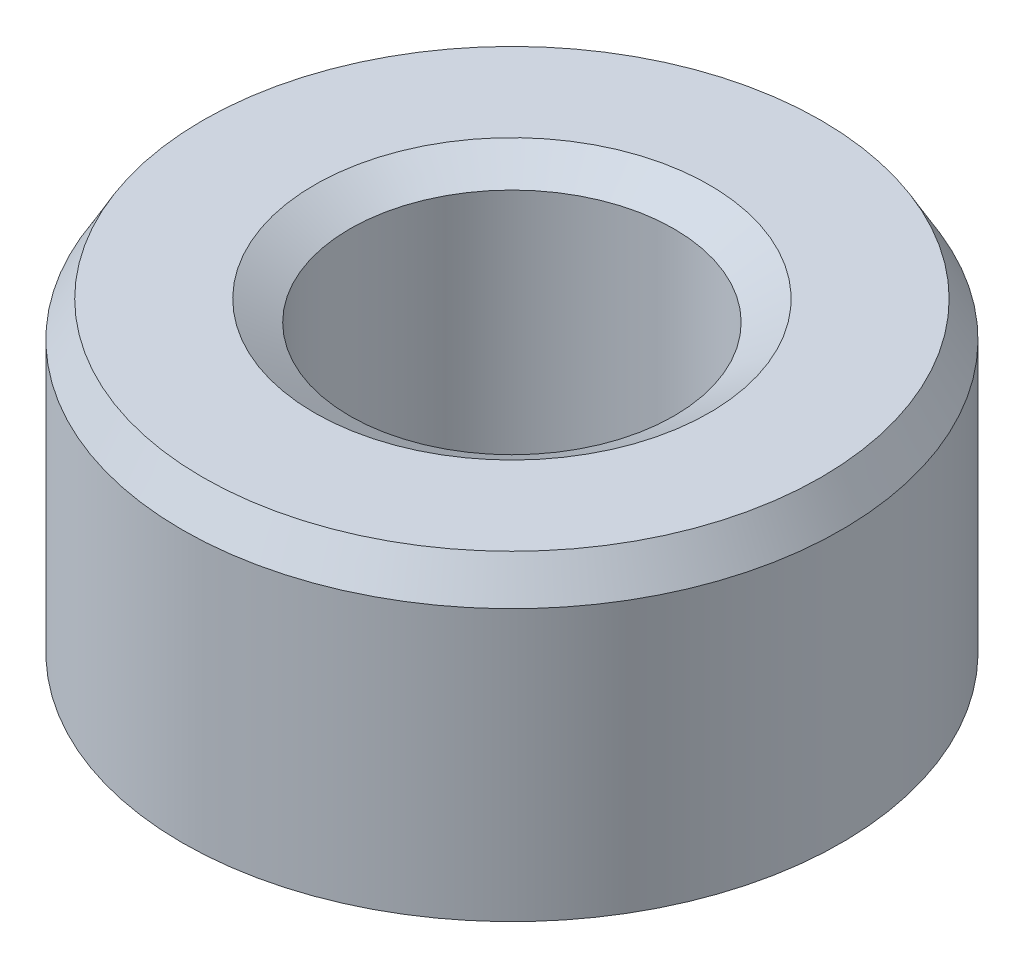
ISO-10303-21;
HEADER;
FILE_DESCRIPTION(('STEP AP214'),'2;1');
FILE_NAME('part.step','',(''),(''),'','','');
FILE_SCHEMA(('AUTOMOTIVE_DESIGN { 1 0 10303 214 1 1 1 1 }'));
ENDSEC;
DATA;
#1=APPLICATION_CONTEXT('core data for automotive mechanical design processes');
#2=APPLICATION_PROTOCOL_DEFINITION('international standard','automotive_design',2000,#1);
#3=PRODUCT_CONTEXT('',#1,'mechanical');
#4=PRODUCT('Part','Part','',(#3));
#5=PRODUCT_RELATED_PRODUCT_CATEGORY('part','',(#4));
#6=PRODUCT_DEFINITION_FORMATION('','',#4);
#7=PRODUCT_DEFINITION_CONTEXT('part definition',#1,'design');
#8=PRODUCT_DEFINITION('design','',#6,#7);
#9=PRODUCT_DEFINITION_SHAPE('','',#8);
#10=(LENGTH_UNIT() NAMED_UNIT(*) SI_UNIT(.MILLI.,.METRE.));
#11=(NAMED_UNIT(*) PLANE_ANGLE_UNIT() SI_UNIT($,.RADIAN.));
#12=(NAMED_UNIT(*) SI_UNIT($,.STERADIAN.) SOLID_ANGLE_UNIT());
#13=UNCERTAINTY_MEASURE_WITH_UNIT(LENGTH_MEASURE(1.E-05),#10,'distance_accuracy_value','');
#14=(GEOMETRIC_REPRESENTATION_CONTEXT(3) GLOBAL_UNCERTAINTY_ASSIGNED_CONTEXT((#13)) GLOBAL_UNIT_ASSIGNED_CONTEXT((#10,
#11,#12)) REPRESENTATION_CONTEXT('',''));
#15=CARTESIAN_POINT('',(0.,0.,0.));
#16=DIRECTION('',(0.,0.,1.));
#17=DIRECTION('',(1.,0.,0.));
#18=AXIS2_PLACEMENT_3D('',#15,#16,#17);
#19=CARTESIAN_POINT('',(0.,34.6985275008784,0.));
#20=DIRECTION('',(0.,-1.,0.));
#21=DIRECTION('',(0.,0.,-1.));
#22=AXIS2_PLACEMENT_3D('',#19,#20,#21);
#23=CYLINDRICAL_SURFACE('',#22,35.);
#24=CARTESIAN_POINT('',(0.,2.16580570600962,0.));
#25=DIRECTION('',(0.,1.,0.));
#26=DIRECTION('',(0.,0.,1.));
#27=AXIS2_PLACEMENT_3D('',#24,#25,#26);
#28=CIRCLE('',#27,35.);
#29=CARTESIAN_POINT('',(0.,2.16580570600962,35.));
#30=VERTEX_POINT('',#29);
#31=EDGE_CURVE('E10',#30,#30,#28,.T.);
#32=ORIENTED_EDGE('',*,*,#31,.T.);
#33=EDGE_LOOP('',(#32));
#34=FACE_BOUND('',#33,.T.);
#35=CARTESIAN_POINT('',(0.,30.947241978747,0.));
#36=DIRECTION('',(0.,1.,0.));
#37=DIRECTION('',(0.,0.,1.));
#38=AXIS2_PLACEMENT_3D('',#35,#36,#37);
#39=CIRCLE('',#38,35.);
#40=CARTESIAN_POINT('',(0.,30.947241978747,35.));
#41=VERTEX_POINT('',#40);
#42=EDGE_CURVE('E50',#41,#41,#39,.F.);
#43=ORIENTED_EDGE('',*,*,#42,.T.);
#44=EDGE_LOOP('',(#43));
#45=FACE_BOUND('',#44,.T.);
#46=ADVANCED_FACE('F39',(#34,#45),#23,.T.);
#47=CARTESIAN_POINT('',(0.,34.6985275008784,0.));
#48=DIRECTION('',(0.,1.,0.));
#49=DIRECTION('',(0.,0.,1.));
#50=AXIS2_PLACEMENT_3D('',#47,#48,#49);
#51=PLANE('',#50);
#52=CARTESIAN_POINT('',(0.,34.6985275008784,0.));
#53=DIRECTION('',(0.,1.,0.));
#54=DIRECTION('',(0.,0.,1.));
#55=AXIS2_PLACEMENT_3D('',#52,#53,#54);
#56=CIRCLE('',#55,20.9676494009495);
#57=CARTESIAN_POINT('',(0.,34.6985275008784,20.9676494009495));
#58=VERTEX_POINT('',#57);
#59=EDGE_CURVE('E58',#58,#58,#56,.F.);
#60=ORIENTED_EDGE('',*,*,#59,.T.);
#61=EDGE_LOOP('',(#60));
#62=FACE_BOUND('',#61,.T.);
#63=CARTESIAN_POINT('',(0.,34.6985275008784,0.));
#64=DIRECTION('',(0.,1.,0.));
#65=DIRECTION('',(0.,0.,1.));
#66=AXIS2_PLACEMENT_3D('',#63,#64,#65);
#67=CIRCLE('',#66,32.8341942939904);
#68=CARTESIAN_POINT('',(0.,34.6985275008784,32.8341942939904));
#69=VERTEX_POINT('',#68);
#70=EDGE_CURVE('E61',#69,#69,#67,.T.);
#71=ORIENTED_EDGE('',*,*,#70,.T.);
#72=EDGE_LOOP('',(#71));
#73=FACE_BOUND('',#72,.T.);
#74=ADVANCED_FACE('F88',(#62,#73),#51,.T.);
#75=CARTESIAN_POINT('',(0.,0.,0.));
#76=DIRECTION('',(0.,1.,0.));
#77=DIRECTION('',(0.,0.,1.));
#78=AXIS2_PLACEMENT_3D('',#75,#76,#77);
#79=PLANE('',#78);
#80=CARTESIAN_POINT('',(0.,0.,0.));
#81=DIRECTION('',(0.,1.,0.));
#82=DIRECTION('',(0.,0.,1.));
#83=AXIS2_PLACEMENT_3D('',#80,#81,#82);
#84=CIRCLE('',#83,19.3821695848279);
#85=CARTESIAN_POINT('',(0.,0.,19.3821695848279));
#86=VERTEX_POINT('',#85);
#87=EDGE_CURVE('E51',#86,#86,#84,.T.);
#88=ORIENTED_EDGE('',*,*,#87,.T.);
#89=EDGE_LOOP('',(#88));
#90=FACE_BOUND('',#89,.T.);
#91=CARTESIAN_POINT('',(0.,0.,0.));
#92=DIRECTION('',(0.,1.,0.));
#93=DIRECTION('',(0.,0.,1.));
#94=AXIS2_PLACEMENT_3D('',#91,#92,#93);
#95=CIRCLE('',#94,31.2487144778687);
#96=CARTESIAN_POINT('',(0.,0.,31.2487144778687));
#97=VERTEX_POINT('',#96);
#98=EDGE_CURVE('E54',#97,#97,#95,.F.);
#99=ORIENTED_EDGE('',*,*,#98,.T.);
#100=EDGE_LOOP('',(#99));
#101=FACE_BOUND('',#100,.T.);
#102=ADVANCED_FACE('F83',(#90,#101),#79,.F.);
#103=CARTESIAN_POINT('',(0.,34.6985275008784,0.));
#104=DIRECTION('',(0.,-1.,0.));
#105=DIRECTION('',(0.,0.,-1.));
#106=AXIS2_PLACEMENT_3D('',#103,#104,#105);
#107=CYLINDRICAL_SURFACE('',#106,17.2163638788183);
#108=CARTESIAN_POINT('',(0.,32.5327217948687,0.));
#109=DIRECTION('',(0.,1.,0.));
#110=DIRECTION('',(0.,0.,1.));
#111=AXIS2_PLACEMENT_3D('',#108,#109,#110);
#112=CIRCLE('',#111,17.2163638788183);
#113=CARTESIAN_POINT('',(0.,32.5327217948687,17.2163638788183));
#114=VERTEX_POINT('',#113);
#115=EDGE_CURVE('E67',#114,#114,#112,.T.);
#116=ORIENTED_EDGE('',*,*,#115,.T.);
#117=EDGE_LOOP('',(#116));
#118=FACE_BOUND('',#117,.T.);
#119=CARTESIAN_POINT('',(0.,3.75128552213129,0.));
#120=DIRECTION('',(0.,1.,0.));
#121=DIRECTION('',(0.,0.,1.));
#122=AXIS2_PLACEMENT_3D('',#119,#120,#121);
#123=CIRCLE('',#122,17.2163638788183);
#124=CARTESIAN_POINT('',(0.,3.75128552213129,17.2163638788183));
#125=VERTEX_POINT('',#124);
#126=EDGE_CURVE('E69',#125,#125,#123,.F.);
#127=ORIENTED_EDGE('',*,*,#126,.T.);
#128=EDGE_LOOP('',(#127));
#129=FACE_BOUND('',#128,.T.);
#130=ADVANCED_FACE('F71',(#118,#129),#107,.F.);
#131=CARTESIAN_POINT('',(0.,32.5327217948687,0.));
#132=DIRECTION('',(0.,1.,0.));
#133=DIRECTION('',(0.,0.,1.));
#134=AXIS2_PLACEMENT_3D('',#131,#132,#133);
#135=CONICAL_SURFACE('',#134,17.2163638788183,1.0471975511966);
#136=ORIENTED_EDGE('',*,*,#59,.F.);
#137=EDGE_LOOP('',(#136));
#138=FACE_BOUND('',#137,.T.);
#139=ORIENTED_EDGE('',*,*,#115,.F.);
#140=EDGE_LOOP('',(#139));
#141=FACE_BOUND('',#140,.T.);
#142=ADVANCED_FACE('F77',(#138,#141),#135,.F.);
#143=CARTESIAN_POINT('',(0.,0.,0.));
#144=DIRECTION('',(0.,-1.,0.));
#145=DIRECTION('',(0.,0.,-1.));
#146=AXIS2_PLACEMENT_3D('',#143,#144,#145);
#147=CONICAL_SURFACE('',#146,19.3821695848279,0.523598775598294);
#148=ORIENTED_EDGE('',*,*,#126,.F.);
#149=EDGE_LOOP('',(#148));
#150=FACE_BOUND('',#149,.T.);
#151=ORIENTED_EDGE('',*,*,#87,.F.);
#152=EDGE_LOOP('',(#151));
#153=FACE_BOUND('',#152,.T.);
#154=ADVANCED_FACE('F73',(#150,#153),#147,.F.);
#155=CARTESIAN_POINT('',(0.,2.16580570600962,0.));
#156=DIRECTION('',(0.,1.,0.));
#157=DIRECTION('',(0.,0.,1.));
#158=AXIS2_PLACEMENT_3D('',#155,#156,#157);
#159=CONICAL_SURFACE('',#158,35.,1.0471975511966);
#160=ORIENTED_EDGE('',*,*,#98,.F.);
#161=EDGE_LOOP('',(#160));
#162=FACE_BOUND('',#161,.T.);
#163=ORIENTED_EDGE('',*,*,#31,.F.);
#164=EDGE_LOOP('',(#163));
#165=FACE_BOUND('',#164,.T.);
#166=ADVANCED_FACE('F76',(#162,#165),#159,.T.);
#167=CARTESIAN_POINT('',(0.,34.6985275008784,0.));
#168=DIRECTION('',(0.,-1.,0.));
#169=DIRECTION('',(0.,0.,-1.));
#170=AXIS2_PLACEMENT_3D('',#167,#168,#169);
#171=CONICAL_SURFACE('',#170,32.8341942939904,0.523598775598294);
#172=ORIENTED_EDGE('',*,*,#42,.F.);
#173=EDGE_LOOP('',(#172));
#174=FACE_BOUND('',#173,.T.);
#175=ORIENTED_EDGE('',*,*,#70,.F.);
#176=EDGE_LOOP('',(#175));
#177=FACE_BOUND('',#176,.T.);
#178=ADVANCED_FACE('F45',(#174,#177),#171,.T.);
#179=CLOSED_SHELL('',(#46,#74,#102,#130,#142,#154,#166,#178));
#180=MANIFOLD_SOLID_BREP('B2',#179);
#181=ADVANCED_BREP_SHAPE_REPRESENTATION('',(#18,#180),#14);
#182=SHAPE_DEFINITION_REPRESENTATION(#9,#181);
ENDSEC;
END-ISO-10303-21;
